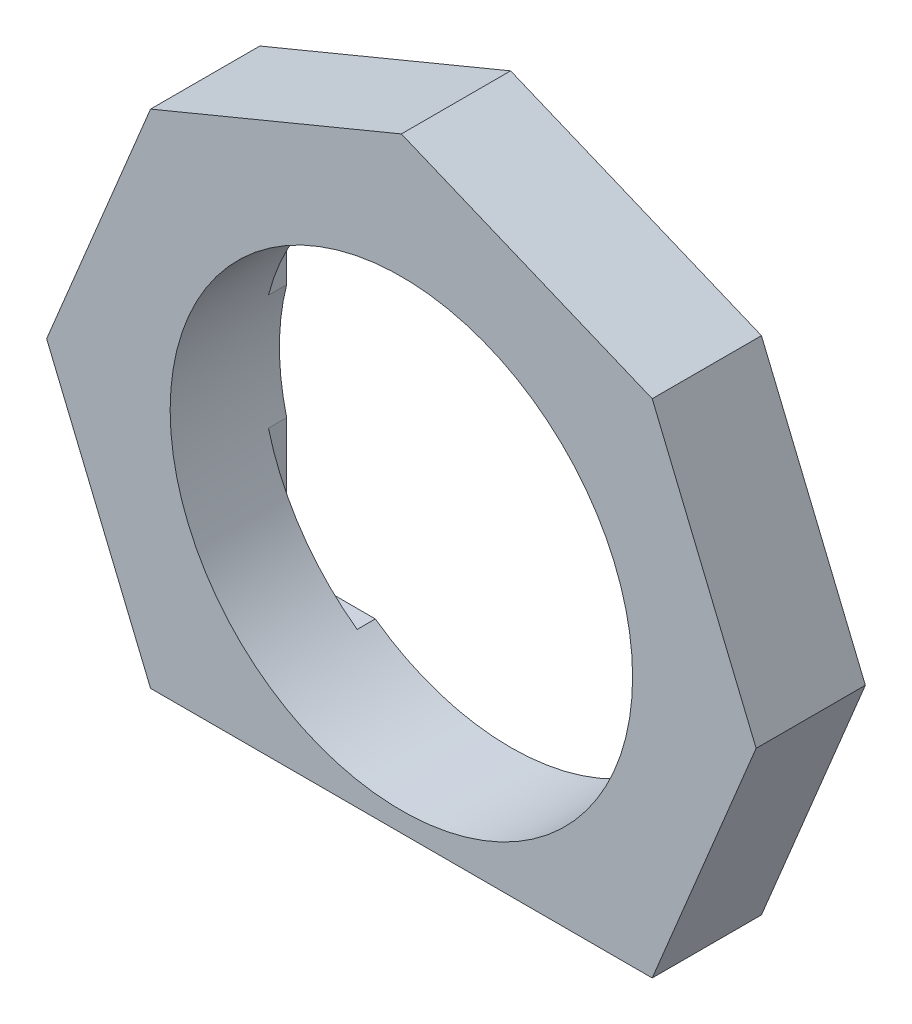
ISO-10303-21;
HEADER;
FILE_DESCRIPTION(('STEP AP214'),'2;1');
FILE_NAME('part.step','',(''),(''),'','','');
FILE_SCHEMA(('AUTOMOTIVE_DESIGN { 1 0 10303 214 1 1 1 1 }'));
ENDSEC;
DATA;
#1=APPLICATION_CONTEXT('core data for automotive mechanical design processes');
#2=APPLICATION_PROTOCOL_DEFINITION('international standard','automotive_design',2000,#1);
#3=PRODUCT_CONTEXT('',#1,'mechanical');
#4=PRODUCT('Part','Part','',(#3));
#5=PRODUCT_RELATED_PRODUCT_CATEGORY('part','',(#4));
#6=PRODUCT_DEFINITION_FORMATION('','',#4);
#7=PRODUCT_DEFINITION_CONTEXT('part definition',#1,'design');
#8=PRODUCT_DEFINITION('design','',#6,#7);
#9=PRODUCT_DEFINITION_SHAPE('','',#8);
#10=(LENGTH_UNIT() NAMED_UNIT(*) SI_UNIT(.MILLI.,.METRE.));
#11=(NAMED_UNIT(*) PLANE_ANGLE_UNIT() SI_UNIT($,.RADIAN.));
#12=(NAMED_UNIT(*) SI_UNIT($,.STERADIAN.) SOLID_ANGLE_UNIT());
#13=UNCERTAINTY_MEASURE_WITH_UNIT(LENGTH_MEASURE(1.E-05),#10,'distance_accuracy_value','');
#14=(GEOMETRIC_REPRESENTATION_CONTEXT(3) GLOBAL_UNCERTAINTY_ASSIGNED_CONTEXT((#13)) GLOBAL_UNIT_ASSIGNED_CONTEXT((#10,
#11,#12)) REPRESENTATION_CONTEXT('',''));
#15=CARTESIAN_POINT('',(0.,0.,0.));
#16=DIRECTION('',(0.,0.,1.));
#17=DIRECTION('',(1.,0.,0.));
#18=AXIS2_PLACEMENT_3D('',#15,#16,#17);
#19=CARTESIAN_POINT('',(6.15,-5.15,0.5));
#20=DIRECTION('',(0.,-1.,0.));
#21=DIRECTION('',(0.,0.,-1.));
#22=AXIS2_PLACEMENT_3D('',#19,#20,#21);
#23=PLANE('',#22);
#24=DIRECTION('',(-1.,0.,0.));
#25=VECTOR('',#24,1.);
#26=CARTESIAN_POINT('',(6.15,-5.15,0.));
#27=LINE('',#26,#25);
#28=CARTESIAN_POINT('',(5.65,-5.15,0.));
#29=VERTEX_POINT('',#28);
#30=CARTESIAN_POINT('',(3.71483512420134,-5.15,0.));
#31=VERTEX_POINT('',#30);
#32=EDGE_CURVE('E388',#29,#31,#27,.T.);
#33=ORIENTED_EDGE('',*,*,#32,.T.);
#34=DIRECTION('',(0.,0.,1.));
#35=VECTOR('',#34,1.);
#36=CARTESIAN_POINT('',(3.71483512420134,-5.15,3.));
#37=LINE('',#36,#35);
#38=CARTESIAN_POINT('',(3.71483512420134,-5.15,0.5));
#39=VERTEX_POINT('',#38);
#40=EDGE_CURVE('E419',#31,#39,#37,.T.);
#41=ORIENTED_EDGE('',*,*,#40,.T.);
#42=DIRECTION('',(-1.,0.,0.));
#43=VECTOR('',#42,1.);
#44=CARTESIAN_POINT('',(6.15,-5.15,0.5));
#45=LINE('',#44,#43);
#46=CARTESIAN_POINT('',(5.65,-5.15,0.5));
#47=VERTEX_POINT('',#46);
#48=EDGE_CURVE('E242',#47,#39,#45,.T.);
#49=ORIENTED_EDGE('',*,*,#48,.F.);
#50=DIRECTION('',(0.,0.,-1.));
#51=VECTOR('',#50,1.);
#52=CARTESIAN_POINT('',(5.65,-5.15,0.));
#53=LINE('',#52,#51);
#54=EDGE_CURVE('E282',#47,#29,#53,.T.);
#55=ORIENTED_EDGE('',*,*,#54,.T.);
#56=EDGE_LOOP('',(#33,#41,#49,#55));
#57=FACE_BOUND('',#56,.T.);
#58=ADVANCED_FACE('F41',(#57),#23,.F.);
#59=CARTESIAN_POINT('',(-6.15,-5.15,0.5));
#60=DIRECTION('',(-1.,0.,0.));
#61=DIRECTION('',(0.,0.,1.));
#62=AXIS2_PLACEMENT_3D('',#59,#60,#61);
#63=PLANE('',#62);
#64=DIRECTION('',(0.,1.,0.));
#65=VECTOR('',#64,1.);
#66=CARTESIAN_POINT('',(-6.15,-5.15,0.));
#67=LINE('',#66,#65);
#68=CARTESIAN_POINT('',(-6.15,-4.65,0.));
#69=VERTEX_POINT('',#68);
#70=CARTESIAN_POINT('',(-6.15,-1.58113883008419,0.));
#71=VERTEX_POINT('',#70);
#72=EDGE_CURVE('E363',#69,#71,#67,.T.);
#73=ORIENTED_EDGE('',*,*,#72,.T.);
#74=DIRECTION('',(0.,0.,1.));
#75=VECTOR('',#74,1.);
#76=CARTESIAN_POINT('',(-6.15,-1.58113883008419,3.));
#77=LINE('',#76,#75);
#78=CARTESIAN_POINT('',(-6.15,-1.58113883008419,0.5));
#79=VERTEX_POINT('',#78);
#80=EDGE_CURVE('E370',#71,#79,#77,.T.);
#81=ORIENTED_EDGE('',*,*,#80,.T.);
#82=DIRECTION('',(0.,1.,0.));
#83=VECTOR('',#82,1.);
#84=CARTESIAN_POINT('',(-6.15,-5.15,0.5));
#85=LINE('',#84,#83);
#86=CARTESIAN_POINT('',(-6.15,-4.65,0.5));
#87=VERTEX_POINT('',#86);
#88=EDGE_CURVE('E444',#87,#79,#85,.T.);
#89=ORIENTED_EDGE('',*,*,#88,.F.);
#90=DIRECTION('',(0.,0.,-1.));
#91=VECTOR('',#90,1.);
#92=CARTESIAN_POINT('',(-6.15,-4.65,0.));
#93=LINE('',#92,#91);
#94=EDGE_CURVE('E310',#87,#69,#93,.T.);
#95=ORIENTED_EDGE('',*,*,#94,.T.);
#96=EDGE_LOOP('',(#73,#81,#89,#95));
#97=FACE_BOUND('',#96,.T.);
#98=ADVANCED_FACE('F368',(#97),#63,.F.);
#99=CARTESIAN_POINT('',(6.15,5.15,0.5));
#100=DIRECTION('',(0.,1.,0.));
#101=DIRECTION('',(0.,0.,1.));
#102=AXIS2_PLACEMENT_3D('',#99,#100,#101);
#103=PLANE('',#102);
#104=DIRECTION('',(1.,0.,0.));
#105=VECTOR('',#104,1.);
#106=CARTESIAN_POINT('',(6.15,5.15,0.));
#107=LINE('',#106,#105);
#108=CARTESIAN_POINT('',(-5.65,5.15,0.));
#109=VERTEX_POINT('',#108);
#110=CARTESIAN_POINT('',(-3.71483512420134,5.15,0.));
#111=VERTEX_POINT('',#110);
#112=EDGE_CURVE('E377',#109,#111,#107,.T.);
#113=ORIENTED_EDGE('',*,*,#112,.T.);
#114=DIRECTION('',(0.,0.,1.));
#115=VECTOR('',#114,1.);
#116=CARTESIAN_POINT('',(-3.71483512420134,5.15,3.));
#117=LINE('',#116,#115);
#118=CARTESIAN_POINT('',(-3.71483512420134,5.15,0.5));
#119=VERTEX_POINT('',#118);
#120=EDGE_CURVE('E432',#111,#119,#117,.T.);
#121=ORIENTED_EDGE('',*,*,#120,.T.);
#122=DIRECTION('',(1.,0.,0.));
#123=VECTOR('',#122,1.);
#124=CARTESIAN_POINT('',(6.15,5.15,0.5));
#125=LINE('',#124,#123);
#126=CARTESIAN_POINT('',(-5.65,5.15,0.5));
#127=VERTEX_POINT('',#126);
#128=EDGE_CURVE('E448',#127,#119,#125,.T.);
#129=ORIENTED_EDGE('',*,*,#128,.F.);
#130=DIRECTION('',(0.,0.,-1.));
#131=VECTOR('',#130,1.);
#132=CARTESIAN_POINT('',(-5.65,5.15,0.));
#133=LINE('',#132,#131);
#134=EDGE_CURVE('E317',#127,#109,#133,.T.);
#135=ORIENTED_EDGE('',*,*,#134,.T.);
#136=EDGE_LOOP('',(#113,#121,#129,#135));
#137=FACE_BOUND('',#136,.T.);
#138=ADVANCED_FACE('F506',(#137),#103,.F.);
#139=CARTESIAN_POINT('',(6.15,-5.15,0.5));
#140=DIRECTION('',(1.,0.,0.));
#141=DIRECTION('',(0.,0.,-1.));
#142=AXIS2_PLACEMENT_3D('',#139,#140,#141);
#143=PLANE('',#142);
#144=DIRECTION('',(0.,-1.,0.));
#145=VECTOR('',#144,1.);
#146=CARTESIAN_POINT('',(6.15,-5.15,0.));
#147=LINE('',#146,#145);
#148=CARTESIAN_POINT('',(6.15,4.65,0.));
#149=VERTEX_POINT('',#148);
#150=CARTESIAN_POINT('',(6.15,1.5811388300842,0.));
#151=VERTEX_POINT('',#150);
#152=EDGE_CURVE('E384',#149,#151,#147,.T.);
#153=ORIENTED_EDGE('',*,*,#152,.T.);
#154=DIRECTION('',(0.,0.,1.));
#155=VECTOR('',#154,1.);
#156=CARTESIAN_POINT('',(6.15,1.58113883008419,3.));
#157=LINE('',#156,#155);
#158=CARTESIAN_POINT('',(6.15,1.5811388300842,0.5));
#159=VERTEX_POINT('',#158);
#160=EDGE_CURVE('E58',#151,#159,#157,.T.);
#161=ORIENTED_EDGE('',*,*,#160,.T.);
#162=DIRECTION('',(0.,-1.,0.));
#163=VECTOR('',#162,1.);
#164=CARTESIAN_POINT('',(6.15,-5.15,0.5));
#165=LINE('',#164,#163);
#166=CARTESIAN_POINT('',(6.15,4.65,0.5));
#167=VERTEX_POINT('',#166);
#168=EDGE_CURVE('E452',#167,#159,#165,.T.);
#169=ORIENTED_EDGE('',*,*,#168,.F.);
#170=DIRECTION('',(0.,0.,-1.));
#171=VECTOR('',#170,1.);
#172=CARTESIAN_POINT('',(6.15,4.65,0.));
#173=LINE('',#172,#171);
#174=EDGE_CURVE('E286',#167,#149,#173,.T.);
#175=ORIENTED_EDGE('',*,*,#174,.T.);
#176=EDGE_LOOP('',(#153,#161,#169,#175));
#177=FACE_BOUND('',#176,.T.);
#178=ADVANCED_FACE('F504',(#177),#143,.F.);
#179=CARTESIAN_POINT('',(0.,0.,0.5));
#180=DIRECTION('',(0.,0.,1.));
#181=DIRECTION('',(1.,0.,0.));
#182=AXIS2_PLACEMENT_3D('',#179,#180,#181);
#183=PLANE('',#182);
#184=ORIENTED_EDGE('',*,*,#168,.T.);
#185=CARTESIAN_POINT('',(0.,0.,0.5));
#186=DIRECTION('',(0.,0.,1.));
#187=DIRECTION('',(1.,0.,0.));
#188=AXIS2_PLACEMENT_3D('',#185,#186,#187);
#189=CIRCLE('',#188,6.35);
#190=CARTESIAN_POINT('',(3.71483512420134,5.15,0.5));
#191=VERTEX_POINT('',#190);
#192=EDGE_CURVE('E11',#159,#191,#189,.T.);
#193=ORIENTED_EDGE('',*,*,#192,.T.);
#194=CARTESIAN_POINT('',(5.65,5.15,0.5));
#195=VERTEX_POINT('',#194);
#196=EDGE_CURVE('E447',#191,#195,#125,.T.);
#197=ORIENTED_EDGE('',*,*,#196,.T.);
#198=CARTESIAN_POINT('',(5.65,4.65,0.5));
#199=DIRECTION('',(0.,0.,1.));
#200=DIRECTION('',(1.,0.,0.));
#201=AXIS2_PLACEMENT_3D('',#198,#199,#200);
#202=CIRCLE('',#201,0.5);
#203=EDGE_CURVE('E294',#195,#167,#202,.F.);
#204=ORIENTED_EDGE('',*,*,#203,.T.);
#205=EDGE_LOOP('',(#184,#193,#197,#204));
#206=FACE_BOUND('',#205,.T.);
#207=ADVANCED_FACE('F498',(#206),#183,.F.);
#208=ORIENTED_EDGE('',*,*,#128,.T.);
#209=CARTESIAN_POINT('',(-6.15,1.58113883008419,0.5));
#210=VERTEX_POINT('',#209);
#211=EDGE_CURVE('E51',#119,#210,#189,.T.);
#212=ORIENTED_EDGE('',*,*,#211,.T.);
#213=CARTESIAN_POINT('',(-6.15,4.65,0.5));
#214=VERTEX_POINT('',#213);
#215=EDGE_CURVE('E392',#210,#214,#85,.T.);
#216=ORIENTED_EDGE('',*,*,#215,.T.);
#217=CARTESIAN_POINT('',(-5.65,4.65,0.5));
#218=DIRECTION('',(0.,0.,1.));
#219=DIRECTION('',(1.,0.,0.));
#220=AXIS2_PLACEMENT_3D('',#217,#218,#219);
#221=CIRCLE('',#220,0.5);
#222=EDGE_CURVE('E297',#214,#127,#221,.F.);
#223=ORIENTED_EDGE('',*,*,#222,.T.);
#224=EDGE_LOOP('',(#208,#212,#216,#223));
#225=FACE_BOUND('',#224,.T.);
#226=ADVANCED_FACE('F487',(#225),#183,.F.);
#227=ORIENTED_EDGE('',*,*,#88,.T.);
#228=CARTESIAN_POINT('',(-3.71483512420134,-5.15,0.5));
#229=VERTEX_POINT('',#228);
#230=EDGE_CURVE('E356',#79,#229,#189,.T.);
#231=ORIENTED_EDGE('',*,*,#230,.T.);
#232=CARTESIAN_POINT('',(-5.65,-5.15,0.5));
#233=VERTEX_POINT('',#232);
#234=EDGE_CURVE('E455',#229,#233,#45,.T.);
#235=ORIENTED_EDGE('',*,*,#234,.T.);
#236=CARTESIAN_POINT('',(-5.65,-4.65,0.5));
#237=DIRECTION('',(0.,0.,1.));
#238=DIRECTION('',(1.,0.,0.));
#239=AXIS2_PLACEMENT_3D('',#236,#237,#238);
#240=CIRCLE('',#239,0.5);
#241=EDGE_CURVE('E300',#233,#87,#240,.F.);
#242=ORIENTED_EDGE('',*,*,#241,.T.);
#243=EDGE_LOOP('',(#227,#231,#235,#242));
#244=FACE_BOUND('',#243,.T.);
#245=ADVANCED_FACE('F481',(#244),#183,.F.);
#246=CARTESIAN_POINT('',(6.88830178257162,6.88830178257161,3.));
#247=DIRECTION('',(-0.38268343236509,-0.923879532511287,0.));
#248=DIRECTION('',(0.923879532511287,-0.38268343236509,0.));
#249=AXIS2_PLACEMENT_3D('',#246,#247,#248);
#250=PLANE('',#249);
#251=DIRECTION('',(-0.923879532511287,0.38268343236509,0.));
#252=VECTOR('',#251,1.);
#253=CARTESIAN_POINT('',(6.88830178257162,6.88830178257161,0.));
#254=LINE('',#253,#252);
#255=CARTESIAN_POINT('',(6.88830178257162,6.88830178257161,0.));
#256=VERTEX_POINT('',#255);
#257=CARTESIAN_POINT('',(0.,9.74152980263155,0.));
#258=VERTEX_POINT('',#257);
#259=EDGE_CURVE('E237',#256,#258,#254,.T.);
#260=ORIENTED_EDGE('',*,*,#259,.T.);
#261=DIRECTION('',(0.,0.,-1.));
#262=VECTOR('',#261,1.);
#263=CARTESIAN_POINT('',(0.,9.74152980263155,3.));
#264=LINE('',#263,#262);
#265=CARTESIAN_POINT('',(0.,9.74152980263155,3.));
#266=VERTEX_POINT('',#265);
#267=EDGE_CURVE('E274',#266,#258,#264,.T.);
#268=ORIENTED_EDGE('',*,*,#267,.F.);
#269=DIRECTION('',(-0.923879532511287,0.38268343236509,0.));
#270=VECTOR('',#269,1.);
#271=CARTESIAN_POINT('',(6.88830178257162,6.88830178257161,3.));
#272=LINE('',#271,#270);
#273=CARTESIAN_POINT('',(6.88830178257162,6.88830178257161,3.));
#274=VERTEX_POINT('',#273);
#275=EDGE_CURVE('E258',#274,#266,#272,.T.);
#276=ORIENTED_EDGE('',*,*,#275,.F.);
#277=DIRECTION('',(0.,0.,-1.));
#278=VECTOR('',#277,1.);
#279=CARTESIAN_POINT('',(6.88830178257162,6.88830178257161,3.));
#280=LINE('',#279,#278);
#281=EDGE_CURVE('E231',#274,#256,#280,.T.);
#282=ORIENTED_EDGE('',*,*,#281,.T.);
#283=EDGE_LOOP('',(#260,#268,#276,#282));
#284=FACE_BOUND('',#283,.T.);
#285=ADVANCED_FACE('F547',(#284),#250,.F.);
#286=CARTESIAN_POINT('',(0.,9.74152980263155,3.));
#287=DIRECTION('',(0.38268343236509,-0.923879532511287,0.));
#288=DIRECTION('',(0.923879532511287,0.38268343236509,0.));
#289=AXIS2_PLACEMENT_3D('',#286,#287,#288);
#290=PLANE('',#289);
#291=DIRECTION('',(-0.923879532511287,-0.38268343236509,0.));
#292=VECTOR('',#291,1.);
#293=CARTESIAN_POINT('',(0.,9.74152980263155,0.));
#294=LINE('',#293,#292);
#295=CARTESIAN_POINT('',(-6.88830178257161,6.88830178257162,0.));
#296=VERTEX_POINT('',#295);
#297=EDGE_CURVE('E241',#258,#296,#294,.T.);
#298=ORIENTED_EDGE('',*,*,#297,.T.);
#299=DIRECTION('',(0.,0.,-1.));
#300=VECTOR('',#299,1.);
#301=CARTESIAN_POINT('',(-6.88830178257161,6.88830178257162,3.));
#302=LINE('',#301,#300);
#303=CARTESIAN_POINT('',(-6.88830178257161,6.88830178257162,3.));
#304=VERTEX_POINT('',#303);
#305=EDGE_CURVE('E270',#304,#296,#302,.T.);
#306=ORIENTED_EDGE('',*,*,#305,.F.);
#307=DIRECTION('',(-0.923879532511287,-0.38268343236509,0.));
#308=VECTOR('',#307,1.);
#309=CARTESIAN_POINT('',(0.,9.74152980263155,3.));
#310=LINE('',#309,#308);
#311=EDGE_CURVE('E396',#266,#304,#310,.T.);
#312=ORIENTED_EDGE('',*,*,#311,.F.);
#313=ORIENTED_EDGE('',*,*,#267,.T.);
#314=EDGE_LOOP('',(#298,#306,#312,#313));
#315=FACE_BOUND('',#314,.T.);
#316=ADVANCED_FACE('F544',(#315),#290,.F.);
#317=CARTESIAN_POINT('',(-6.88830178257161,6.88830178257162,3.));
#318=DIRECTION('',(0.923879532511287,-0.382683432365089,0.));
#319=DIRECTION('',(0.38268343236509,0.923879532511287,0.));
#320=AXIS2_PLACEMENT_3D('',#317,#318,#319);
#321=PLANE('',#320);
#322=DIRECTION('',(-0.382683432365089,-0.923879532511287,0.));
#323=VECTOR('',#322,1.);
#324=CARTESIAN_POINT('',(-6.88830178257161,6.88830178257162,0.));
#325=LINE('',#324,#323);
#326=CARTESIAN_POINT('',(-9.74152980263154,0.,0.));
#327=VERTEX_POINT('',#326);
#328=EDGE_CURVE('E245',#296,#327,#325,.T.);
#329=ORIENTED_EDGE('',*,*,#328,.T.);
#330=DIRECTION('',(0.,0.,-1.));
#331=VECTOR('',#330,1.);
#332=CARTESIAN_POINT('',(-9.74152980263154,0.,3.));
#333=LINE('',#332,#331);
#334=CARTESIAN_POINT('',(-9.74152980263154,0.,3.));
#335=VERTEX_POINT('',#334);
#336=EDGE_CURVE('E266',#335,#327,#333,.T.);
#337=ORIENTED_EDGE('',*,*,#336,.F.);
#338=DIRECTION('',(-0.382683432365089,-0.923879532511287,0.));
#339=VECTOR('',#338,1.);
#340=CARTESIAN_POINT('',(-6.88830178257161,6.88830178257162,3.));
#341=LINE('',#340,#339);
#342=EDGE_CURVE('E233',#304,#335,#341,.T.);
#343=ORIENTED_EDGE('',*,*,#342,.F.);
#344=ORIENTED_EDGE('',*,*,#305,.T.);
#345=EDGE_LOOP('',(#329,#337,#343,#344));
#346=FACE_BOUND('',#345,.T.);
#347=ADVANCED_FACE('F403',(#346),#321,.F.);
#348=CARTESIAN_POINT('',(-9.74152980263154,0.,3.));
#349=DIRECTION('',(0.923879532511287,0.38268343236509,0.));
#350=DIRECTION('',(-0.38268343236509,0.923879532511287,0.));
#351=AXIS2_PLACEMENT_3D('',#348,#349,#350);
#352=PLANE('',#351);
#353=DIRECTION('',(0.38268343236509,-0.923879532511287,0.));
#354=VECTOR('',#353,1.);
#355=CARTESIAN_POINT('',(-9.74152980263154,0.,0.));
#356=LINE('',#355,#354);
#357=CARTESIAN_POINT('',(-6.88830178257161,-6.88830178257162,0.));
#358=VERTEX_POINT('',#357);
#359=EDGE_CURVE('E248',#327,#358,#356,.T.);
#360=ORIENTED_EDGE('',*,*,#359,.T.);
#361=DIRECTION('',(0.,0.,-1.));
#362=VECTOR('',#361,1.);
#363=CARTESIAN_POINT('',(-6.88830178257161,-6.88830178257162,3.));
#364=LINE('',#363,#362);
#365=CARTESIAN_POINT('',(-6.88830178257161,-6.88830178257162,3.));
#366=VERTEX_POINT('',#365);
#367=EDGE_CURVE('E210',#366,#358,#364,.T.);
#368=ORIENTED_EDGE('',*,*,#367,.F.);
#369=DIRECTION('',(0.38268343236509,-0.923879532511287,0.));
#370=VECTOR('',#369,1.);
#371=CARTESIAN_POINT('',(-9.74152980263154,0.,3.));
#372=LINE('',#371,#370);
#373=EDGE_CURVE('E219',#335,#366,#372,.T.);
#374=ORIENTED_EDGE('',*,*,#373,.F.);
#375=ORIENTED_EDGE('',*,*,#336,.T.);
#376=EDGE_LOOP('',(#360,#368,#374,#375));
#377=FACE_BOUND('',#376,.T.);
#378=ADVANCED_FACE('F407',(#377),#352,.F.);
#379=CARTESIAN_POINT('',(6.88830178257162,-6.88830178257162,3.));
#380=DIRECTION('',(-0.923879532511286,0.38268343236509,0.));
#381=DIRECTION('',(-0.38268343236509,-0.923879532511287,0.));
#382=AXIS2_PLACEMENT_3D('',#379,#380,#381);
#383=PLANE('',#382);
#384=DIRECTION('',(0.38268343236509,0.923879532511287,0.));
#385=VECTOR('',#384,1.);
#386=CARTESIAN_POINT('',(6.88830178257162,-6.88830178257162,0.));
#387=LINE('',#386,#385);
#388=CARTESIAN_POINT('',(6.88830178257162,-6.88830178257162,0.));
#389=VERTEX_POINT('',#388);
#390=CARTESIAN_POINT('',(9.74152980263155,0.,0.));
#391=VERTEX_POINT('',#390);
#392=EDGE_CURVE('E252',#389,#391,#387,.T.);
#393=ORIENTED_EDGE('',*,*,#392,.T.);
#394=DIRECTION('',(0.,0.,-1.));
#395=VECTOR('',#394,1.);
#396=CARTESIAN_POINT('',(9.74152980263155,0.,3.));
#397=LINE('',#396,#395);
#398=CARTESIAN_POINT('',(9.74152980263155,0.,3.));
#399=VERTEX_POINT('',#398);
#400=EDGE_CURVE('E211',#399,#391,#397,.T.);
#401=ORIENTED_EDGE('',*,*,#400,.F.);
#402=DIRECTION('',(0.38268343236509,0.923879532511287,0.));
#403=VECTOR('',#402,1.);
#404=CARTESIAN_POINT('',(6.88830178257162,-6.88830178257162,3.));
#405=LINE('',#404,#403);
#406=CARTESIAN_POINT('',(6.88830178257162,-6.88830178257162,3.));
#407=VERTEX_POINT('',#406);
#408=EDGE_CURVE('E216',#407,#399,#405,.T.);
#409=ORIENTED_EDGE('',*,*,#408,.F.);
#410=DIRECTION('',(0.,0.,-1.));
#411=VECTOR('',#410,1.);
#412=CARTESIAN_POINT('',(6.88830178257162,-6.88830178257162,3.));
#413=LINE('',#412,#411);
#414=EDGE_CURVE('E199',#407,#389,#413,.T.);
#415=ORIENTED_EDGE('',*,*,#414,.T.);
#416=EDGE_LOOP('',(#393,#401,#409,#415));
#417=FACE_BOUND('',#416,.T.);
#418=ADVANCED_FACE('F223',(#417),#383,.F.);
#419=CARTESIAN_POINT('',(9.74152980263155,0.,3.));
#420=DIRECTION('',(-0.923879532511287,-0.38268343236509,0.));
#421=DIRECTION('',(0.38268343236509,-0.923879532511287,0.));
#422=AXIS2_PLACEMENT_3D('',#419,#420,#421);
#423=PLANE('',#422);
#424=DIRECTION('',(-0.38268343236509,0.923879532511287,0.));
#425=VECTOR('',#424,1.);
#426=CARTESIAN_POINT('',(9.74152980263155,0.,0.));
#427=LINE('',#426,#425);
#428=EDGE_CURVE('E255',#391,#256,#427,.T.);
#429=ORIENTED_EDGE('',*,*,#428,.T.);
#430=ORIENTED_EDGE('',*,*,#281,.F.);
#431=DIRECTION('',(-0.38268343236509,0.923879532511287,0.));
#432=VECTOR('',#431,1.);
#433=CARTESIAN_POINT('',(9.74152980263155,0.,3.));
#434=LINE('',#433,#432);
#435=EDGE_CURVE('E227',#399,#274,#434,.T.);
#436=ORIENTED_EDGE('',*,*,#435,.F.);
#437=ORIENTED_EDGE('',*,*,#400,.T.);
#438=EDGE_LOOP('',(#429,#430,#436,#437));
#439=FACE_BOUND('',#438,.T.);
#440=ADVANCED_FACE('F533',(#439),#423,.F.);
#441=CARTESIAN_POINT('',(0.,0.,3.));
#442=DIRECTION('',(0.,0.,1.));
#443=DIRECTION('',(1.,0.,0.));
#444=AXIS2_PLACEMENT_3D('',#441,#442,#443);
#445=PLANE('',#444);
#446=DIRECTION('',(1.,0.,0.));
#447=VECTOR('',#446,1.);
#448=CARTESIAN_POINT('',(6.88830178257162,-6.88830178257162,3.));
#449=LINE('',#448,#447);
#450=EDGE_CURVE('E202',#366,#407,#449,.T.);
#451=ORIENTED_EDGE('',*,*,#450,.T.);
#452=ORIENTED_EDGE('',*,*,#408,.T.);
#453=ORIENTED_EDGE('',*,*,#435,.T.);
#454=ORIENTED_EDGE('',*,*,#275,.T.);
#455=ORIENTED_EDGE('',*,*,#311,.T.);
#456=ORIENTED_EDGE('',*,*,#342,.T.);
#457=ORIENTED_EDGE('',*,*,#373,.T.);
#458=EDGE_LOOP('',(#451,#452,#453,#454,#455,#456,#457));
#459=FACE_BOUND('',#458,.T.);
#460=CARTESIAN_POINT('',(0.,0.,3.));
#461=DIRECTION('',(0.,0.,1.));
#462=DIRECTION('',(1.,0.,0.));
#463=AXIS2_PLACEMENT_3D('',#460,#461,#462);
#464=CIRCLE('',#463,6.35);
#465=CARTESIAN_POINT('',(6.35,0.,3.));
#466=VERTEX_POINT('',#465);
#467=EDGE_CURVE('E410',#466,#466,#464,.T.);
#468=ORIENTED_EDGE('',*,*,#467,.F.);
#469=EDGE_LOOP('',(#468));
#470=FACE_BOUND('',#469,.T.);
#471=ADVANCED_FACE('F214',(#459,#470),#445,.T.);
#472=CARTESIAN_POINT('',(0.,0.,0.));
#473=DIRECTION('',(0.,0.,1.));
#474=DIRECTION('',(1.,0.,0.));
#475=AXIS2_PLACEMENT_3D('',#472,#473,#474);
#476=PLANE('',#475);
#477=CARTESIAN_POINT('',(3.71483512420134,5.15,0.));
#478=VERTEX_POINT('',#477);
#479=CARTESIAN_POINT('',(5.65,5.15,0.));
#480=VERTEX_POINT('',#479);
#481=EDGE_CURVE('E66',#478,#480,#107,.T.);
#482=ORIENTED_EDGE('',*,*,#481,.F.);
#483=CARTESIAN_POINT('',(0.,0.,0.));
#484=DIRECTION('',(0.,0.,1.));
#485=DIRECTION('',(1.,0.,0.));
#486=AXIS2_PLACEMENT_3D('',#483,#484,#485);
#487=CIRCLE('',#486,6.35);
#488=EDGE_CURVE('E341',#478,#111,#487,.T.);
#489=ORIENTED_EDGE('',*,*,#488,.T.);
#490=ORIENTED_EDGE('',*,*,#112,.F.);
#491=CARTESIAN_POINT('',(-5.65,4.65,0.));
#492=DIRECTION('',(0.,0.,1.));
#493=DIRECTION('',(1.,0.,0.));
#494=AXIS2_PLACEMENT_3D('',#491,#492,#493);
#495=CIRCLE('',#494,0.5);
#496=CARTESIAN_POINT('',(-6.15,4.65,0.));
#497=VERTEX_POINT('',#496);
#498=EDGE_CURVE('E329',#109,#497,#495,.T.);
#499=ORIENTED_EDGE('',*,*,#498,.T.);
#500=CARTESIAN_POINT('',(-6.15,1.58113883008419,0.));
#501=VERTEX_POINT('',#500);
#502=EDGE_CURVE('E364',#501,#497,#67,.T.);
#503=ORIENTED_EDGE('',*,*,#502,.F.);
#504=EDGE_CURVE('E346',#501,#71,#487,.T.);
#505=ORIENTED_EDGE('',*,*,#504,.T.);
#506=ORIENTED_EDGE('',*,*,#72,.F.);
#507=CARTESIAN_POINT('',(-5.65,-4.65,0.));
#508=DIRECTION('',(0.,0.,1.));
#509=DIRECTION('',(1.,0.,0.));
#510=AXIS2_PLACEMENT_3D('',#507,#508,#509);
#511=CIRCLE('',#510,0.5);
#512=CARTESIAN_POINT('',(-5.65,-5.15,0.));
#513=VERTEX_POINT('',#512);
#514=EDGE_CURVE('E325',#69,#513,#511,.T.);
#515=ORIENTED_EDGE('',*,*,#514,.T.);
#516=CARTESIAN_POINT('',(-3.71483512420134,-5.15,0.));
#517=VERTEX_POINT('',#516);
#518=EDGE_CURVE('E387',#517,#513,#27,.T.);
#519=ORIENTED_EDGE('',*,*,#518,.F.);
#520=EDGE_CURVE('E339',#517,#31,#487,.T.);
#521=ORIENTED_EDGE('',*,*,#520,.T.);
#522=ORIENTED_EDGE('',*,*,#32,.F.);
#523=CARTESIAN_POINT('',(5.65,-4.65,0.));
#524=DIRECTION('',(0.,0.,1.));
#525=DIRECTION('',(1.,0.,0.));
#526=AXIS2_PLACEMENT_3D('',#523,#524,#525);
#527=CIRCLE('',#526,0.5);
#528=CARTESIAN_POINT('',(6.15,-4.65,0.));
#529=VERTEX_POINT('',#528);
#530=EDGE_CURVE('E321',#29,#529,#527,.T.);
#531=ORIENTED_EDGE('',*,*,#530,.T.);
#532=CARTESIAN_POINT('',(6.15,-1.5811388300842,0.));
#533=VERTEX_POINT('',#532);
#534=EDGE_CURVE('E383',#533,#529,#147,.T.);
#535=ORIENTED_EDGE('',*,*,#534,.F.);
#536=EDGE_CURVE('E334',#533,#151,#487,.T.);
#537=ORIENTED_EDGE('',*,*,#536,.T.);
#538=ORIENTED_EDGE('',*,*,#152,.F.);
#539=CARTESIAN_POINT('',(5.65,4.65,0.));
#540=DIRECTION('',(0.,0.,1.));
#541=DIRECTION('',(1.,0.,0.));
#542=AXIS2_PLACEMENT_3D('',#539,#540,#541);
#543=CIRCLE('',#542,0.5);
#544=EDGE_CURVE('E332',#149,#480,#543,.T.);
#545=ORIENTED_EDGE('',*,*,#544,.T.);
#546=EDGE_LOOP('',(#482,#489,#490,#499,#503,#505,#506,#515,#519,#521,#522,#531,#535,#537,#538,#545));
#547=FACE_BOUND('',#546,.T.);
#548=ORIENTED_EDGE('',*,*,#392,.F.);
#549=DIRECTION('',(1.,0.,0.));
#550=VECTOR('',#549,1.);
#551=CARTESIAN_POINT('',(6.88830178257162,-6.88830178257162,0.));
#552=LINE('',#551,#550);
#553=EDGE_CURVE('E205',#358,#389,#552,.T.);
#554=ORIENTED_EDGE('',*,*,#553,.F.);
#555=ORIENTED_EDGE('',*,*,#359,.F.);
#556=ORIENTED_EDGE('',*,*,#328,.F.);
#557=ORIENTED_EDGE('',*,*,#297,.F.);
#558=ORIENTED_EDGE('',*,*,#259,.F.);
#559=ORIENTED_EDGE('',*,*,#428,.F.);
#560=EDGE_LOOP('',(#548,#554,#555,#556,#557,#558,#559));
#561=FACE_BOUND('',#560,.T.);
#562=ADVANCED_FACE('F361',(#547,#561),#476,.F.);
#563=ORIENTED_EDGE('',*,*,#215,.F.);
#564=DIRECTION('',(0.,0.,1.));
#565=VECTOR('',#564,1.);
#566=CARTESIAN_POINT('',(-6.15,1.58113883008419,3.));
#567=LINE('',#566,#565);
#568=EDGE_CURVE('E436',#210,#501,#567,.F.);
#569=ORIENTED_EDGE('',*,*,#568,.T.);
#570=ORIENTED_EDGE('',*,*,#502,.T.);
#571=DIRECTION('',(0.,0.,-1.));
#572=VECTOR('',#571,1.);
#573=CARTESIAN_POINT('',(-6.15,4.65,0.5));
#574=LINE('',#573,#572);
#575=EDGE_CURVE('E306',#497,#214,#574,.F.);
#576=ORIENTED_EDGE('',*,*,#575,.T.);
#577=EDGE_LOOP('',(#563,#569,#570,#576));
#578=FACE_BOUND('',#577,.T.);
#579=ADVANCED_FACE('F490',(#578),#63,.F.);
#580=ORIENTED_EDGE('',*,*,#234,.F.);
#581=DIRECTION('',(0.,0.,1.));
#582=VECTOR('',#581,1.);
#583=CARTESIAN_POINT('',(-3.71483512420134,-5.15,3.));
#584=LINE('',#583,#582);
#585=EDGE_CURVE('E428',#229,#517,#584,.F.);
#586=ORIENTED_EDGE('',*,*,#585,.T.);
#587=ORIENTED_EDGE('',*,*,#518,.T.);
#588=DIRECTION('',(0.,0.,-1.));
#589=VECTOR('',#588,1.);
#590=CARTESIAN_POINT('',(-5.65,-5.15,0.5));
#591=LINE('',#590,#589);
#592=EDGE_CURVE('E278',#513,#233,#591,.F.);
#593=ORIENTED_EDGE('',*,*,#592,.T.);
#594=EDGE_LOOP('',(#580,#586,#587,#593));
#595=FACE_BOUND('',#594,.T.);
#596=ADVANCED_FACE('F477',(#595),#23,.F.);
#597=CARTESIAN_POINT('',(6.15,-1.5811388300842,0.5));
#598=VERTEX_POINT('',#597);
#599=CARTESIAN_POINT('',(6.15,-4.65,0.5));
#600=VERTEX_POINT('',#599);
#601=EDGE_CURVE('E451',#598,#600,#165,.T.);
#602=ORIENTED_EDGE('',*,*,#601,.F.);
#603=DIRECTION('',(0.,0.,1.));
#604=VECTOR('',#603,1.);
#605=CARTESIAN_POINT('',(6.15,-1.58113883008419,3.));
#606=LINE('',#605,#604);
#607=EDGE_CURVE('E414',#598,#533,#606,.F.);
#608=ORIENTED_EDGE('',*,*,#607,.T.);
#609=ORIENTED_EDGE('',*,*,#534,.T.);
#610=DIRECTION('',(0.,0.,-1.));
#611=VECTOR('',#610,1.);
#612=CARTESIAN_POINT('',(6.15,-4.65,0.5));
#613=LINE('',#612,#611);
#614=EDGE_CURVE('E290',#529,#600,#613,.F.);
#615=ORIENTED_EDGE('',*,*,#614,.T.);
#616=EDGE_LOOP('',(#602,#608,#609,#615));
#617=FACE_BOUND('',#616,.T.);
#618=ADVANCED_FACE('F466',(#617),#143,.F.);
#619=ORIENTED_EDGE('',*,*,#196,.F.);
#620=DIRECTION('',(0.,0.,1.));
#621=VECTOR('',#620,1.);
#622=CARTESIAN_POINT('',(3.71483512420134,5.15,3.));
#623=LINE('',#622,#621);
#624=EDGE_CURVE('E439',#191,#478,#623,.F.);
#625=ORIENTED_EDGE('',*,*,#624,.T.);
#626=ORIENTED_EDGE('',*,*,#481,.T.);
#627=DIRECTION('',(0.,0.,-1.));
#628=VECTOR('',#627,1.);
#629=CARTESIAN_POINT('',(5.65,5.15,0.5));
#630=LINE('',#629,#628);
#631=EDGE_CURVE('E314',#480,#195,#630,.F.);
#632=ORIENTED_EDGE('',*,*,#631,.T.);
#633=EDGE_LOOP('',(#619,#625,#626,#632));
#634=FACE_BOUND('',#633,.T.);
#635=ADVANCED_FACE('F500',(#634),#103,.F.);
#636=ORIENTED_EDGE('',*,*,#48,.T.);
#637=EDGE_CURVE('E45',#39,#598,#189,.T.);
#638=ORIENTED_EDGE('',*,*,#637,.T.);
#639=ORIENTED_EDGE('',*,*,#601,.T.);
#640=CARTESIAN_POINT('',(5.65,-4.65,0.5));
#641=DIRECTION('',(0.,0.,1.));
#642=DIRECTION('',(1.,0.,0.));
#643=AXIS2_PLACEMENT_3D('',#640,#641,#642);
#644=CIRCLE('',#643,0.5);
#645=EDGE_CURVE('E303',#600,#47,#644,.F.);
#646=ORIENTED_EDGE('',*,*,#645,.T.);
#647=EDGE_LOOP('',(#636,#638,#639,#646));
#648=FACE_BOUND('',#647,.T.);
#649=ADVANCED_FACE('F462',(#648),#183,.F.);
#650=CARTESIAN_POINT('',(5.65,-4.65,0.5));
#651=DIRECTION('',(0.,0.,1.));
#652=DIRECTION('',(1.,0.,0.));
#653=AXIS2_PLACEMENT_3D('',#650,#651,#652);
#654=CYLINDRICAL_SURFACE('',#653,0.5);
#655=ORIENTED_EDGE('',*,*,#645,.F.);
#656=ORIENTED_EDGE('',*,*,#614,.F.);
#657=ORIENTED_EDGE('',*,*,#530,.F.);
#658=ORIENTED_EDGE('',*,*,#54,.F.);
#659=EDGE_LOOP('',(#655,#656,#657,#658));
#660=FACE_BOUND('',#659,.T.);
#661=ADVANCED_FACE('F469',(#660),#654,.F.);
#662=CARTESIAN_POINT('',(-5.65,-4.65,0.5));
#663=DIRECTION('',(0.,0.,1.));
#664=DIRECTION('',(1.,0.,0.));
#665=AXIS2_PLACEMENT_3D('',#662,#663,#664);
#666=CYLINDRICAL_SURFACE('',#665,0.5);
#667=ORIENTED_EDGE('',*,*,#241,.F.);
#668=ORIENTED_EDGE('',*,*,#592,.F.);
#669=ORIENTED_EDGE('',*,*,#514,.F.);
#670=ORIENTED_EDGE('',*,*,#94,.F.);
#671=EDGE_LOOP('',(#667,#668,#669,#670));
#672=FACE_BOUND('',#671,.T.);
#673=ADVANCED_FACE('F554',(#672),#666,.F.);
#674=CARTESIAN_POINT('',(-5.65,4.65,0.5));
#675=DIRECTION('',(0.,0.,1.));
#676=DIRECTION('',(1.,0.,0.));
#677=AXIS2_PLACEMENT_3D('',#674,#675,#676);
#678=CYLINDRICAL_SURFACE('',#677,0.5);
#679=ORIENTED_EDGE('',*,*,#222,.F.);
#680=ORIENTED_EDGE('',*,*,#575,.F.);
#681=ORIENTED_EDGE('',*,*,#498,.F.);
#682=ORIENTED_EDGE('',*,*,#134,.F.);
#683=EDGE_LOOP('',(#679,#680,#681,#682));
#684=FACE_BOUND('',#683,.T.);
#685=ADVANCED_FACE('F556',(#684),#678,.F.);
#686=CARTESIAN_POINT('',(5.65,4.65,0.5));
#687=DIRECTION('',(0.,0.,1.));
#688=DIRECTION('',(1.,0.,0.));
#689=AXIS2_PLACEMENT_3D('',#686,#687,#688);
#690=CYLINDRICAL_SURFACE('',#689,0.5);
#691=ORIENTED_EDGE('',*,*,#203,.F.);
#692=ORIENTED_EDGE('',*,*,#631,.F.);
#693=ORIENTED_EDGE('',*,*,#544,.F.);
#694=ORIENTED_EDGE('',*,*,#174,.F.);
#695=EDGE_LOOP('',(#691,#692,#693,#694));
#696=FACE_BOUND('',#695,.T.);
#697=ADVANCED_FACE('F43',(#696),#690,.F.);
#698=CARTESIAN_POINT('',(0.,0.,3.));
#699=DIRECTION('',(0.,0.,1.));
#700=DIRECTION('',(1.,0.,0.));
#701=AXIS2_PLACEMENT_3D('',#698,#699,#700);
#702=CYLINDRICAL_SURFACE('',#701,6.35);
#703=ORIENTED_EDGE('',*,*,#467,.T.);
#704=EDGE_LOOP('',(#703));
#705=FACE_BOUND('',#704,.T.);
#706=ORIENTED_EDGE('',*,*,#536,.F.);
#707=ORIENTED_EDGE('',*,*,#607,.F.);
#708=ORIENTED_EDGE('',*,*,#637,.F.);
#709=ORIENTED_EDGE('',*,*,#40,.F.);
#710=ORIENTED_EDGE('',*,*,#520,.F.);
#711=ORIENTED_EDGE('',*,*,#585,.F.);
#712=ORIENTED_EDGE('',*,*,#230,.F.);
#713=ORIENTED_EDGE('',*,*,#80,.F.);
#714=ORIENTED_EDGE('',*,*,#504,.F.);
#715=ORIENTED_EDGE('',*,*,#568,.F.);
#716=ORIENTED_EDGE('',*,*,#211,.F.);
#717=ORIENTED_EDGE('',*,*,#120,.F.);
#718=ORIENTED_EDGE('',*,*,#488,.F.);
#719=ORIENTED_EDGE('',*,*,#624,.F.);
#720=ORIENTED_EDGE('',*,*,#192,.F.);
#721=ORIENTED_EDGE('',*,*,#160,.F.);
#722=EDGE_LOOP('',(#706,#707,#708,#709,#710,#711,#712,#713,#714,#715,#716,#717,#718,#719,#720,#721));
#723=FACE_BOUND('',#722,.T.);
#724=ADVANCED_FACE('F473',(#705,#723),#702,.F.);
#725=CARTESIAN_POINT('',(6.88830178257162,-6.88830178257162,3.001));
#726=DIRECTION('',(0.,1.,0.));
#727=DIRECTION('',(0.,0.,1.));
#728=AXIS2_PLACEMENT_3D('',#725,#726,#727);
#729=PLANE('',#728);
#730=ORIENTED_EDGE('',*,*,#367,.T.);
#731=ORIENTED_EDGE('',*,*,#553,.T.);
#732=ORIENTED_EDGE('',*,*,#414,.F.);
#733=ORIENTED_EDGE('',*,*,#450,.F.);
#734=EDGE_LOOP('',(#730,#731,#732,#733));
#735=FACE_BOUND('',#734,.T.);
#736=ADVANCED_FACE('F201',(#735),#729,.F.);
#737=CLOSED_SHELL('',(#58,#98,#138,#178,#207,#226,#245,#285,#316,#347,#378,#418,#440,#471,#562,
#579,#596,#618,#635,#649,#661,#673,#685,#697,#724,#736));
#738=MANIFOLD_SOLID_BREP('B2',#737);
#739=ADVANCED_BREP_SHAPE_REPRESENTATION('',(#18,#738),#14);
#740=SHAPE_DEFINITION_REPRESENTATION(#9,#739);
ENDSEC;
END-ISO-10303-21;
